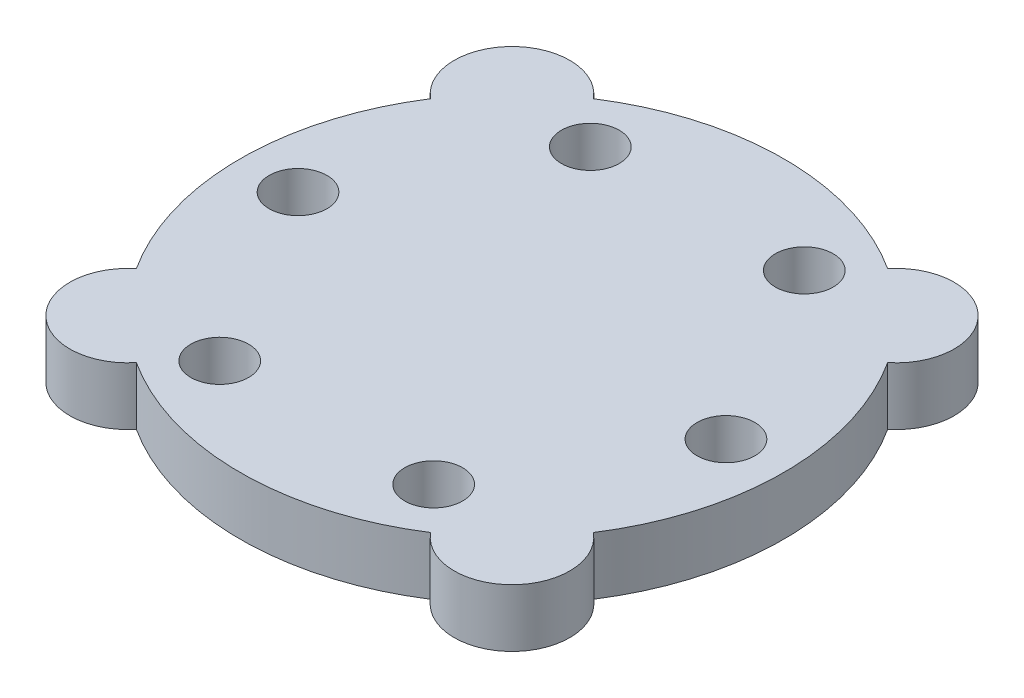
ISO-10303-21;
HEADER;
FILE_DESCRIPTION(('STEP AP214'),'2;1');
FILE_NAME('part.step','',(''),(''),'','','');
FILE_SCHEMA(('AUTOMOTIVE_DESIGN { 1 0 10303 214 1 1 1 1 }'));
ENDSEC;
DATA;
#1=APPLICATION_CONTEXT('core data for automotive mechanical design processes');
#2=APPLICATION_PROTOCOL_DEFINITION('international standard','automotive_design',2000,#1);
#3=PRODUCT_CONTEXT('',#1,'mechanical');
#4=PRODUCT('Part','Part','',(#3));
#5=PRODUCT_RELATED_PRODUCT_CATEGORY('part','',(#4));
#6=PRODUCT_DEFINITION_FORMATION('','',#4);
#7=PRODUCT_DEFINITION_CONTEXT('part definition',#1,'design');
#8=PRODUCT_DEFINITION('design','',#6,#7);
#9=PRODUCT_DEFINITION_SHAPE('','',#8);
#10=(LENGTH_UNIT() NAMED_UNIT(*) SI_UNIT(.MILLI.,.METRE.));
#11=(NAMED_UNIT(*) PLANE_ANGLE_UNIT() SI_UNIT($,.RADIAN.));
#12=(NAMED_UNIT(*) SI_UNIT($,.STERADIAN.) SOLID_ANGLE_UNIT());
#13=UNCERTAINTY_MEASURE_WITH_UNIT(LENGTH_MEASURE(1.E-05),#10,'distance_accuracy_value','');
#14=(GEOMETRIC_REPRESENTATION_CONTEXT(3) GLOBAL_UNCERTAINTY_ASSIGNED_CONTEXT((#13)) GLOBAL_UNIT_ASSIGNED_CONTEXT((#10,
#11,#12)) REPRESENTATION_CONTEXT('',''));
#15=CARTESIAN_POINT('',(0.,0.,0.));
#16=DIRECTION('',(0.,0.,1.));
#17=DIRECTION('',(1.,0.,0.));
#18=AXIS2_PLACEMENT_3D('',#15,#16,#17);
#19=CARTESIAN_POINT('',(0.,0.25,0.));
#20=DIRECTION('',(0.,-1.,0.));
#21=DIRECTION('',(0.,0.,-1.));
#22=AXIS2_PLACEMENT_3D('',#19,#20,#21);
#23=CYLINDRICAL_SURFACE('',#22,2.35);
#24=CARTESIAN_POINT('',(0.,-0.25,0.));
#25=DIRECTION('',(0.,1.,0.));
#26=DIRECTION('',(0.,0.,1.));
#27=AXIS2_PLACEMENT_3D('',#24,#25,#26);
#28=CIRCLE('',#27,2.35);
#29=CARTESIAN_POINT('',(-1.27254181674957,-0.25,1.97563592916906));
#30=VERTEX_POINT('',#29);
#31=CARTESIAN_POINT('',(1.27254181674956,-0.25,1.97563592916907));
#32=VERTEX_POINT('',#31);
#33=EDGE_CURVE('E130',#30,#32,#28,.T.);
#34=ORIENTED_EDGE('',*,*,#33,.T.);
#35=DIRECTION('',(0.,-1.,0.));
#36=VECTOR('',#35,1.);
#37=CARTESIAN_POINT('',(1.27254181674956,0.25,1.97563592916907));
#38=LINE('',#37,#36);
#39=CARTESIAN_POINT('',(1.27254181674956,0.25,1.97563592916907));
#40=VERTEX_POINT('',#39);
#41=EDGE_CURVE('E11',#40,#32,#38,.T.);
#42=ORIENTED_EDGE('',*,*,#41,.F.);
#43=CARTESIAN_POINT('',(0.,0.25,0.));
#44=DIRECTION('',(0.,1.,0.));
#45=DIRECTION('',(0.,0.,1.));
#46=AXIS2_PLACEMENT_3D('',#43,#44,#45);
#47=CIRCLE('',#46,2.35);
#48=CARTESIAN_POINT('',(-1.27254181674957,0.25,1.97563592916906));
#49=VERTEX_POINT('',#48);
#50=EDGE_CURVE('E145',#49,#40,#47,.T.);
#51=ORIENTED_EDGE('',*,*,#50,.F.);
#52=DIRECTION('',(0.,-1.,0.));
#53=VECTOR('',#52,1.);
#54=CARTESIAN_POINT('',(-1.27254181674957,0.25,1.97563592916906));
#55=LINE('',#54,#53);
#56=EDGE_CURVE('E126',#49,#30,#55,.T.);
#57=ORIENTED_EDGE('',*,*,#56,.T.);
#58=EDGE_LOOP('',(#34,#42,#51,#57));
#59=FACE_BOUND('',#58,.T.);
#60=ADVANCED_FACE('F34',(#59),#23,.T.);
#61=CARTESIAN_POINT('',(1.66170093578838,0.25,1.66170093578839));
#62=DIRECTION('',(0.,-1.,0.));
#63=DIRECTION('',(0.,0.,-1.));
#64=AXIS2_PLACEMENT_3D('',#61,#62,#63);
#65=CYLINDRICAL_SURFACE('',#64,0.5);
#66=CARTESIAN_POINT('',(1.66170093578838,-0.25,1.66170093578839));
#67=DIRECTION('',(0.,1.,0.));
#68=DIRECTION('',(0.,0.,1.));
#69=AXIS2_PLACEMENT_3D('',#66,#67,#68);
#70=CIRCLE('',#69,0.5);
#71=CARTESIAN_POINT('',(1.97563592916906,-0.25,1.27254181674957));
#72=VERTEX_POINT('',#71);
#73=EDGE_CURVE('E133',#32,#72,#70,.T.);
#74=ORIENTED_EDGE('',*,*,#73,.T.);
#75=DIRECTION('',(0.,-1.,0.));
#76=VECTOR('',#75,1.);
#77=CARTESIAN_POINT('',(1.97563592916906,0.25,1.27254181674957));
#78=LINE('',#77,#76);
#79=CARTESIAN_POINT('',(1.97563592916906,0.25,1.27254181674957));
#80=VERTEX_POINT('',#79);
#81=EDGE_CURVE('E42',#80,#72,#78,.T.);
#82=ORIENTED_EDGE('',*,*,#81,.F.);
#83=CARTESIAN_POINT('',(1.66170093578838,0.25,1.66170093578839));
#84=DIRECTION('',(0.,1.,0.));
#85=DIRECTION('',(0.,0.,1.));
#86=AXIS2_PLACEMENT_3D('',#83,#84,#85);
#87=CIRCLE('',#86,0.5);
#88=EDGE_CURVE('E93',#40,#80,#87,.T.);
#89=ORIENTED_EDGE('',*,*,#88,.F.);
#90=ORIENTED_EDGE('',*,*,#41,.T.);
#91=EDGE_LOOP('',(#74,#82,#89,#90));
#92=FACE_BOUND('',#91,.T.);
#93=ADVANCED_FACE('F247',(#92),#65,.T.);
#94=CARTESIAN_POINT('',(0.,0.25,0.));
#95=DIRECTION('',(0.,-1.,0.));
#96=DIRECTION('',(0.,0.,-1.));
#97=AXIS2_PLACEMENT_3D('',#94,#95,#96);
#98=CYLINDRICAL_SURFACE('',#97,2.35);
#99=CARTESIAN_POINT('',(0.,-0.25,0.));
#100=DIRECTION('',(0.,1.,0.));
#101=DIRECTION('',(0.,0.,1.));
#102=AXIS2_PLACEMENT_3D('',#99,#100,#101);
#103=CIRCLE('',#102,2.35);
#104=CARTESIAN_POINT('',(1.97563592916907,-0.25,-1.27254181674956));
#105=VERTEX_POINT('',#104);
#106=EDGE_CURVE('E136',#72,#105,#103,.T.);
#107=ORIENTED_EDGE('',*,*,#106,.T.);
#108=DIRECTION('',(0.,-1.,0.));
#109=VECTOR('',#108,1.);
#110=CARTESIAN_POINT('',(1.97563592916907,0.25,-1.27254181674956));
#111=LINE('',#110,#109);
#112=CARTESIAN_POINT('',(1.97563592916907,0.25,-1.27254181674956));
#113=VERTEX_POINT('',#112);
#114=EDGE_CURVE('E152',#113,#105,#111,.T.);
#115=ORIENTED_EDGE('',*,*,#114,.F.);
#116=CARTESIAN_POINT('',(0.,0.25,0.));
#117=DIRECTION('',(0.,1.,0.));
#118=DIRECTION('',(0.,0.,1.));
#119=AXIS2_PLACEMENT_3D('',#116,#117,#118);
#120=CIRCLE('',#119,2.35);
#121=EDGE_CURVE('E160',#80,#113,#120,.T.);
#122=ORIENTED_EDGE('',*,*,#121,.F.);
#123=ORIENTED_EDGE('',*,*,#81,.T.);
#124=EDGE_LOOP('',(#107,#115,#122,#123));
#125=FACE_BOUND('',#124,.T.);
#126=ADVANCED_FACE('F158',(#125),#98,.T.);
#127=CARTESIAN_POINT('',(1.66170093578839,0.25,-1.66170093578838));
#128=DIRECTION('',(0.,-1.,0.));
#129=DIRECTION('',(0.,0.,-1.));
#130=AXIS2_PLACEMENT_3D('',#127,#128,#129);
#131=CYLINDRICAL_SURFACE('',#130,0.500000000000001);
#132=CARTESIAN_POINT('',(1.66170093578839,-0.25,-1.66170093578838));
#133=DIRECTION('',(0.,1.,0.));
#134=DIRECTION('',(0.,0.,1.));
#135=AXIS2_PLACEMENT_3D('',#132,#133,#134);
#136=CIRCLE('',#135,0.500000000000001);
#137=CARTESIAN_POINT('',(1.27254181674957,-0.25,-1.97563592916906));
#138=VERTEX_POINT('',#137);
#139=EDGE_CURVE('E138',#105,#138,#136,.T.);
#140=ORIENTED_EDGE('',*,*,#139,.T.);
#141=DIRECTION('',(0.,-1.,0.));
#142=VECTOR('',#141,1.);
#143=CARTESIAN_POINT('',(1.27254181674957,0.25,-1.97563592916906));
#144=LINE('',#143,#142);
#145=CARTESIAN_POINT('',(1.27254181674957,0.25,-1.97563592916906));
#146=VERTEX_POINT('',#145);
#147=EDGE_CURVE('E149',#146,#138,#144,.T.);
#148=ORIENTED_EDGE('',*,*,#147,.F.);
#149=CARTESIAN_POINT('',(1.66170093578839,0.25,-1.66170093578838));
#150=DIRECTION('',(0.,1.,0.));
#151=DIRECTION('',(0.,0.,1.));
#152=AXIS2_PLACEMENT_3D('',#149,#150,#151);
#153=CIRCLE('',#152,0.500000000000001);
#154=EDGE_CURVE('E172',#113,#146,#153,.T.);
#155=ORIENTED_EDGE('',*,*,#154,.F.);
#156=ORIENTED_EDGE('',*,*,#114,.T.);
#157=EDGE_LOOP('',(#140,#148,#155,#156));
#158=FACE_BOUND('',#157,.T.);
#159=ADVANCED_FACE('F168',(#158),#131,.T.);
#160=CARTESIAN_POINT('',(0.,0.25,0.));
#161=DIRECTION('',(0.,-1.,0.));
#162=DIRECTION('',(0.,0.,-1.));
#163=AXIS2_PLACEMENT_3D('',#160,#161,#162);
#164=CYLINDRICAL_SURFACE('',#163,2.35);
#165=CARTESIAN_POINT('',(0.,-0.25,0.));
#166=DIRECTION('',(0.,1.,0.));
#167=DIRECTION('',(0.,0.,1.));
#168=AXIS2_PLACEMENT_3D('',#165,#166,#167);
#169=CIRCLE('',#168,2.35);
#170=CARTESIAN_POINT('',(-1.27254181674956,-0.25,-1.97563592916907));
#171=VERTEX_POINT('',#170);
#172=EDGE_CURVE('E140',#138,#171,#169,.T.);
#173=ORIENTED_EDGE('',*,*,#172,.T.);
#174=DIRECTION('',(0.,-1.,0.));
#175=VECTOR('',#174,1.);
#176=CARTESIAN_POINT('',(-1.27254181674956,0.25,-1.97563592916907));
#177=LINE('',#176,#175);
#178=CARTESIAN_POINT('',(-1.27254181674956,0.25,-1.97563592916907));
#179=VERTEX_POINT('',#178);
#180=EDGE_CURVE('E121',#179,#171,#177,.T.);
#181=ORIENTED_EDGE('',*,*,#180,.F.);
#182=CARTESIAN_POINT('',(0.,0.25,0.));
#183=DIRECTION('',(0.,1.,0.));
#184=DIRECTION('',(0.,0.,1.));
#185=AXIS2_PLACEMENT_3D('',#182,#183,#184);
#186=CIRCLE('',#185,2.35);
#187=EDGE_CURVE('E112',#146,#179,#186,.T.);
#188=ORIENTED_EDGE('',*,*,#187,.F.);
#189=ORIENTED_EDGE('',*,*,#147,.T.);
#190=EDGE_LOOP('',(#173,#181,#188,#189));
#191=FACE_BOUND('',#190,.T.);
#192=ADVANCED_FACE('F171',(#191),#164,.T.);
#193=CARTESIAN_POINT('',(-1.66170093578838,0.25,-1.66170093578839));
#194=DIRECTION('',(0.,-1.,0.));
#195=DIRECTION('',(0.,0.,-1.));
#196=AXIS2_PLACEMENT_3D('',#193,#194,#195);
#197=CYLINDRICAL_SURFACE('',#196,0.5);
#198=CARTESIAN_POINT('',(-1.66170093578838,-0.25,-1.66170093578839));
#199=DIRECTION('',(0.,1.,0.));
#200=DIRECTION('',(0.,0.,1.));
#201=AXIS2_PLACEMENT_3D('',#198,#199,#200);
#202=CIRCLE('',#201,0.5);
#203=CARTESIAN_POINT('',(-1.97563592916906,-0.25,-1.27254181674957));
#204=VERTEX_POINT('',#203);
#205=EDGE_CURVE('E120',#171,#204,#202,.T.);
#206=ORIENTED_EDGE('',*,*,#205,.T.);
#207=DIRECTION('',(0.,-1.,0.));
#208=VECTOR('',#207,1.);
#209=CARTESIAN_POINT('',(-1.97563592916906,0.25,-1.27254181674957));
#210=LINE('',#209,#208);
#211=CARTESIAN_POINT('',(-1.97563592916906,0.25,-1.27254181674957));
#212=VERTEX_POINT('',#211);
#213=EDGE_CURVE('E117',#212,#204,#210,.T.);
#214=ORIENTED_EDGE('',*,*,#213,.F.);
#215=CARTESIAN_POINT('',(-1.66170093578838,0.25,-1.66170093578839));
#216=DIRECTION('',(0.,1.,0.));
#217=DIRECTION('',(0.,0.,1.));
#218=AXIS2_PLACEMENT_3D('',#215,#216,#217);
#219=CIRCLE('',#218,0.5);
#220=EDGE_CURVE('E106',#179,#212,#219,.T.);
#221=ORIENTED_EDGE('',*,*,#220,.F.);
#222=ORIENTED_EDGE('',*,*,#180,.T.);
#223=EDGE_LOOP('',(#206,#214,#221,#222));
#224=FACE_BOUND('',#223,.T.);
#225=ADVANCED_FACE('F118',(#224),#197,.T.);
#226=CARTESIAN_POINT('',(0.,0.25,0.));
#227=DIRECTION('',(0.,-1.,0.));
#228=DIRECTION('',(0.,0.,-1.));
#229=AXIS2_PLACEMENT_3D('',#226,#227,#228);
#230=CYLINDRICAL_SURFACE('',#229,2.35);
#231=CARTESIAN_POINT('',(0.,-0.25,0.));
#232=DIRECTION('',(0.,1.,0.));
#233=DIRECTION('',(0.,0.,1.));
#234=AXIS2_PLACEMENT_3D('',#231,#232,#233);
#235=CIRCLE('',#234,2.35);
#236=CARTESIAN_POINT('',(-1.97563592916907,-0.25,1.27254181674956));
#237=VERTEX_POINT('',#236);
#238=EDGE_CURVE('E79',#204,#237,#235,.T.);
#239=ORIENTED_EDGE('',*,*,#238,.T.);
#240=DIRECTION('',(0.,-1.,0.));
#241=VECTOR('',#240,1.);
#242=CARTESIAN_POINT('',(-1.97563592916907,0.25,1.27254181674956));
#243=LINE('',#242,#241);
#244=CARTESIAN_POINT('',(-1.97563592916907,0.25,1.27254181674956));
#245=VERTEX_POINT('',#244);
#246=EDGE_CURVE('E122',#245,#237,#243,.T.);
#247=ORIENTED_EDGE('',*,*,#246,.F.);
#248=CARTESIAN_POINT('',(0.,0.25,0.));
#249=DIRECTION('',(0.,1.,0.));
#250=DIRECTION('',(0.,0.,1.));
#251=AXIS2_PLACEMENT_3D('',#248,#249,#250);
#252=CIRCLE('',#251,2.35);
#253=EDGE_CURVE('E110',#212,#245,#252,.T.);
#254=ORIENTED_EDGE('',*,*,#253,.F.);
#255=ORIENTED_EDGE('',*,*,#213,.T.);
#256=EDGE_LOOP('',(#239,#247,#254,#255));
#257=FACE_BOUND('',#256,.T.);
#258=ADVANCED_FACE('F124',(#257),#230,.T.);
#259=CARTESIAN_POINT('',(-1.66170093578839,0.25,1.66170093578838));
#260=DIRECTION('',(0.,-1.,0.));
#261=DIRECTION('',(0.,0.,-1.));
#262=AXIS2_PLACEMENT_3D('',#259,#260,#261);
#263=CYLINDRICAL_SURFACE('',#262,0.500000000000001);
#264=CARTESIAN_POINT('',(-1.66170093578839,-0.25,1.66170093578838));
#265=DIRECTION('',(0.,1.,0.));
#266=DIRECTION('',(0.,0.,1.));
#267=AXIS2_PLACEMENT_3D('',#264,#265,#266);
#268=CIRCLE('',#267,0.500000000000001);
#269=EDGE_CURVE('E85',#237,#30,#268,.T.);
#270=ORIENTED_EDGE('',*,*,#269,.T.);
#271=ORIENTED_EDGE('',*,*,#56,.F.);
#272=CARTESIAN_POINT('',(-1.66170093578839,0.25,1.66170093578838));
#273=DIRECTION('',(0.,1.,0.));
#274=DIRECTION('',(0.,0.,1.));
#275=AXIS2_PLACEMENT_3D('',#272,#273,#274);
#276=CIRCLE('',#275,0.500000000000001);
#277=EDGE_CURVE('E50',#245,#49,#276,.T.);
#278=ORIENTED_EDGE('',*,*,#277,.F.);
#279=ORIENTED_EDGE('',*,*,#246,.T.);
#280=EDGE_LOOP('',(#270,#271,#278,#279));
#281=FACE_BOUND('',#280,.T.);
#282=ADVANCED_FACE('F219',(#281),#263,.T.);
#283=CARTESIAN_POINT('',(0.830850467894192,0.25,0.830850467894194));
#284=DIRECTION('',(0.,1.,0.));
#285=DIRECTION('',(0.,0.,1.));
#286=AXIS2_PLACEMENT_3D('',#283,#284,#285);
#287=PLANE('',#286);
#288=CARTESIAN_POINT('',(-0.925000000000019,0.25,1.6021469970012));
#289=DIRECTION('',(0.,1.,0.));
#290=DIRECTION('',(0.,0.,1.));
#291=AXIS2_PLACEMENT_3D('',#288,#289,#290);
#292=CIRCLE('',#291,0.25);
#293=CARTESIAN_POINT('',(-0.925000000000019,0.25,1.8521469970012));
#294=VERTEX_POINT('',#293);
#295=EDGE_CURVE('E210',#294,#294,#292,.T.);
#296=ORIENTED_EDGE('',*,*,#295,.F.);
#297=EDGE_LOOP('',(#296));
#298=FACE_BOUND('',#297,.T.);
#299=CARTESIAN_POINT('',(0.924999999999985,0.25,1.60214699700122));
#300=DIRECTION('',(0.,1.,0.));
#301=DIRECTION('',(0.,0.,1.));
#302=AXIS2_PLACEMENT_3D('',#299,#300,#301);
#303=CIRCLE('',#302,0.250000000000001);
#304=CARTESIAN_POINT('',(0.924999999999985,0.25,1.85214699700122));
#305=VERTEX_POINT('',#304);
#306=EDGE_CURVE('E204',#305,#305,#303,.T.);
#307=ORIENTED_EDGE('',*,*,#306,.F.);
#308=EDGE_LOOP('',(#307));
#309=FACE_BOUND('',#308,.T.);
#310=CARTESIAN_POINT('',(1.85,0.25,0.));
#311=DIRECTION('',(0.,1.,0.));
#312=DIRECTION('',(0.,0.,1.));
#313=AXIS2_PLACEMENT_3D('',#310,#311,#312);
#314=CIRCLE('',#313,0.250000000000005);
#315=CARTESIAN_POINT('',(1.85,0.25,0.250000000000004));
#316=VERTEX_POINT('',#315);
#317=EDGE_CURVE('E198',#316,#316,#314,.T.);
#318=ORIENTED_EDGE('',*,*,#317,.F.);
#319=EDGE_LOOP('',(#318));
#320=FACE_BOUND('',#319,.T.);
#321=CARTESIAN_POINT('',(0.925000000000008,0.25,-1.60214699700121));
#322=DIRECTION('',(0.,1.,0.));
#323=DIRECTION('',(0.,0.,1.));
#324=AXIS2_PLACEMENT_3D('',#321,#322,#323);
#325=CIRCLE('',#324,0.25);
#326=CARTESIAN_POINT('',(0.925000000000008,0.25,-1.35214699700121));
#327=VERTEX_POINT('',#326);
#328=EDGE_CURVE('E192',#327,#327,#325,.T.);
#329=ORIENTED_EDGE('',*,*,#328,.F.);
#330=EDGE_LOOP('',(#329));
#331=FACE_BOUND('',#330,.T.);
#332=CARTESIAN_POINT('',(-0.924999999999996,0.25,-1.60214699700121));
#333=DIRECTION('',(0.,1.,0.));
#334=DIRECTION('',(0.,0.,1.));
#335=AXIS2_PLACEMENT_3D('',#332,#333,#334);
#336=CIRCLE('',#335,0.25);
#337=CARTESIAN_POINT('',(-0.924999999999996,0.25,-1.35214699700121));
#338=VERTEX_POINT('',#337);
#339=EDGE_CURVE('E186',#338,#338,#336,.T.);
#340=ORIENTED_EDGE('',*,*,#339,.F.);
#341=EDGE_LOOP('',(#340));
#342=FACE_BOUND('',#341,.T.);
#343=CARTESIAN_POINT('',(-1.85,0.25,0.));
#344=DIRECTION('',(0.,1.,0.));
#345=DIRECTION('',(0.,0.,1.));
#346=AXIS2_PLACEMENT_3D('',#343,#344,#345);
#347=CIRCLE('',#346,0.250000000000001);
#348=CARTESIAN_POINT('',(-1.85,0.25,0.250000000000001));
#349=VERTEX_POINT('',#348);
#350=EDGE_CURVE('E180',#349,#349,#347,.T.);
#351=ORIENTED_EDGE('',*,*,#350,.F.);
#352=EDGE_LOOP('',(#351));
#353=FACE_BOUND('',#352,.T.);
#354=ORIENTED_EDGE('',*,*,#50,.T.);
#355=ORIENTED_EDGE('',*,*,#88,.T.);
#356=ORIENTED_EDGE('',*,*,#121,.T.);
#357=ORIENTED_EDGE('',*,*,#154,.T.);
#358=ORIENTED_EDGE('',*,*,#187,.T.);
#359=ORIENTED_EDGE('',*,*,#220,.T.);
#360=ORIENTED_EDGE('',*,*,#253,.T.);
#361=ORIENTED_EDGE('',*,*,#277,.T.);
#362=EDGE_LOOP('',(#354,#355,#356,#357,#358,#359,#360,#361));
#363=FACE_BOUND('',#362,.T.);
#364=ADVANCED_FACE('F108',(#298,#309,#320,#331,#342,#353,#363),#287,.T.);
#365=CARTESIAN_POINT('',(0.830850467894192,-0.25,0.830850467894194));
#366=DIRECTION('',(0.,1.,0.));
#367=DIRECTION('',(0.,0.,1.));
#368=AXIS2_PLACEMENT_3D('',#365,#366,#367);
#369=PLANE('',#368);
#370=CARTESIAN_POINT('',(-0.925000000000019,-0.25,1.6021469970012));
#371=DIRECTION('',(0.,1.,0.));
#372=DIRECTION('',(0.,0.,1.));
#373=AXIS2_PLACEMENT_3D('',#370,#371,#372);
#374=CIRCLE('',#373,0.25);
#375=CARTESIAN_POINT('',(-0.925000000000019,-0.25,1.8521469970012));
#376=VERTEX_POINT('',#375);
#377=EDGE_CURVE('E207',#376,#376,#374,.F.);
#378=ORIENTED_EDGE('',*,*,#377,.F.);
#379=EDGE_LOOP('',(#378));
#380=FACE_BOUND('',#379,.T.);
#381=CARTESIAN_POINT('',(0.924999999999985,-0.25,1.60214699700122));
#382=DIRECTION('',(0.,1.,0.));
#383=DIRECTION('',(0.,0.,1.));
#384=AXIS2_PLACEMENT_3D('',#381,#382,#383);
#385=CIRCLE('',#384,0.250000000000001);
#386=CARTESIAN_POINT('',(0.924999999999985,-0.25,1.85214699700122));
#387=VERTEX_POINT('',#386);
#388=EDGE_CURVE('E201',#387,#387,#385,.F.);
#389=ORIENTED_EDGE('',*,*,#388,.F.);
#390=EDGE_LOOP('',(#389));
#391=FACE_BOUND('',#390,.T.);
#392=CARTESIAN_POINT('',(1.85,-0.25,0.));
#393=DIRECTION('',(0.,1.,0.));
#394=DIRECTION('',(0.,0.,1.));
#395=AXIS2_PLACEMENT_3D('',#392,#393,#394);
#396=CIRCLE('',#395,0.250000000000005);
#397=CARTESIAN_POINT('',(1.85,-0.25,0.250000000000004));
#398=VERTEX_POINT('',#397);
#399=EDGE_CURVE('E195',#398,#398,#396,.F.);
#400=ORIENTED_EDGE('',*,*,#399,.F.);
#401=EDGE_LOOP('',(#400));
#402=FACE_BOUND('',#401,.T.);
#403=CARTESIAN_POINT('',(0.925000000000008,-0.25,-1.60214699700121));
#404=DIRECTION('',(0.,1.,0.));
#405=DIRECTION('',(0.,0.,1.));
#406=AXIS2_PLACEMENT_3D('',#403,#404,#405);
#407=CIRCLE('',#406,0.25);
#408=CARTESIAN_POINT('',(0.925000000000008,-0.25,-1.35214699700121));
#409=VERTEX_POINT('',#408);
#410=EDGE_CURVE('E189',#409,#409,#407,.F.);
#411=ORIENTED_EDGE('',*,*,#410,.F.);
#412=EDGE_LOOP('',(#411));
#413=FACE_BOUND('',#412,.T.);
#414=CARTESIAN_POINT('',(-0.924999999999996,-0.25,-1.60214699700121));
#415=DIRECTION('',(0.,1.,0.));
#416=DIRECTION('',(0.,0.,1.));
#417=AXIS2_PLACEMENT_3D('',#414,#415,#416);
#418=CIRCLE('',#417,0.25);
#419=CARTESIAN_POINT('',(-0.924999999999996,-0.25,-1.35214699700121));
#420=VERTEX_POINT('',#419);
#421=EDGE_CURVE('E183',#420,#420,#418,.F.);
#422=ORIENTED_EDGE('',*,*,#421,.F.);
#423=EDGE_LOOP('',(#422));
#424=FACE_BOUND('',#423,.T.);
#425=CARTESIAN_POINT('',(-1.85,-0.25,0.));
#426=DIRECTION('',(0.,1.,0.));
#427=DIRECTION('',(0.,0.,1.));
#428=AXIS2_PLACEMENT_3D('',#425,#426,#427);
#429=CIRCLE('',#428,0.250000000000001);
#430=CARTESIAN_POINT('',(-1.85,-0.25,0.250000000000001));
#431=VERTEX_POINT('',#430);
#432=EDGE_CURVE('E134',#431,#431,#429,.F.);
#433=ORIENTED_EDGE('',*,*,#432,.F.);
#434=EDGE_LOOP('',(#433));
#435=FACE_BOUND('',#434,.T.);
#436=ORIENTED_EDGE('',*,*,#33,.F.);
#437=ORIENTED_EDGE('',*,*,#269,.F.);
#438=ORIENTED_EDGE('',*,*,#238,.F.);
#439=ORIENTED_EDGE('',*,*,#205,.F.);
#440=ORIENTED_EDGE('',*,*,#172,.F.);
#441=ORIENTED_EDGE('',*,*,#139,.F.);
#442=ORIENTED_EDGE('',*,*,#106,.F.);
#443=ORIENTED_EDGE('',*,*,#73,.F.);
#444=EDGE_LOOP('',(#436,#437,#438,#439,#440,#441,#442,#443));
#445=FACE_BOUND('',#444,.T.);
#446=ADVANCED_FACE('F164',(#380,#391,#402,#413,#424,#435,#445),#369,.F.);
#447=CARTESIAN_POINT('',(-1.85,-0.251,0.));
#448=DIRECTION('',(0.,1.,0.));
#449=DIRECTION('',(0.,0.,1.));
#450=AXIS2_PLACEMENT_3D('',#447,#448,#449);
#451=CYLINDRICAL_SURFACE('',#450,0.250000000000001);
#452=ORIENTED_EDGE('',*,*,#350,.T.);
#453=EDGE_LOOP('',(#452));
#454=FACE_BOUND('',#453,.T.);
#455=ORIENTED_EDGE('',*,*,#432,.T.);
#456=EDGE_LOOP('',(#455));
#457=FACE_BOUND('',#456,.T.);
#458=ADVANCED_FACE('F231',(#454,#457),#451,.F.);
#459=CARTESIAN_POINT('',(-0.924999999999996,-0.251,-1.60214699700121));
#460=DIRECTION('',(0.,1.,0.));
#461=DIRECTION('',(0.,0.,1.));
#462=AXIS2_PLACEMENT_3D('',#459,#460,#461);
#463=CYLINDRICAL_SURFACE('',#462,0.25);
#464=ORIENTED_EDGE('',*,*,#339,.T.);
#465=EDGE_LOOP('',(#464));
#466=FACE_BOUND('',#465,.T.);
#467=ORIENTED_EDGE('',*,*,#421,.T.);
#468=EDGE_LOOP('',(#467));
#469=FACE_BOUND('',#468,.T.);
#470=ADVANCED_FACE('F234',(#466,#469),#463,.F.);
#471=CARTESIAN_POINT('',(0.925000000000008,-0.251,-1.60214699700121));
#472=DIRECTION('',(0.,1.,0.));
#473=DIRECTION('',(0.,0.,1.));
#474=AXIS2_PLACEMENT_3D('',#471,#472,#473);
#475=CYLINDRICAL_SURFACE('',#474,0.25);
#476=ORIENTED_EDGE('',*,*,#328,.T.);
#477=EDGE_LOOP('',(#476));
#478=FACE_BOUND('',#477,.T.);
#479=ORIENTED_EDGE('',*,*,#410,.T.);
#480=EDGE_LOOP('',(#479));
#481=FACE_BOUND('',#480,.T.);
#482=ADVANCED_FACE('F316',(#478,#481),#475,.F.);
#483=CARTESIAN_POINT('',(1.85,-0.251,0.));
#484=DIRECTION('',(0.,1.,0.));
#485=DIRECTION('',(0.,0.,1.));
#486=AXIS2_PLACEMENT_3D('',#483,#484,#485);
#487=CYLINDRICAL_SURFACE('',#486,0.250000000000005);
#488=ORIENTED_EDGE('',*,*,#317,.T.);
#489=EDGE_LOOP('',(#488));
#490=FACE_BOUND('',#489,.T.);
#491=ORIENTED_EDGE('',*,*,#399,.T.);
#492=EDGE_LOOP('',(#491));
#493=FACE_BOUND('',#492,.T.);
#494=ADVANCED_FACE('F326',(#490,#493),#487,.F.);
#495=CARTESIAN_POINT('',(0.924999999999985,-0.251,1.60214699700122));
#496=DIRECTION('',(0.,1.,0.));
#497=DIRECTION('',(0.,0.,1.));
#498=AXIS2_PLACEMENT_3D('',#495,#496,#497);
#499=CYLINDRICAL_SURFACE('',#498,0.250000000000001);
#500=ORIENTED_EDGE('',*,*,#306,.T.);
#501=EDGE_LOOP('',(#500));
#502=FACE_BOUND('',#501,.T.);
#503=ORIENTED_EDGE('',*,*,#388,.T.);
#504=EDGE_LOOP('',(#503));
#505=FACE_BOUND('',#504,.T.);
#506=ADVANCED_FACE('F336',(#502,#505),#499,.F.);
#507=CARTESIAN_POINT('',(-0.925000000000019,-0.251,1.6021469970012));
#508=DIRECTION('',(0.,1.,0.));
#509=DIRECTION('',(0.,0.,1.));
#510=AXIS2_PLACEMENT_3D('',#507,#508,#509);
#511=CYLINDRICAL_SURFACE('',#510,0.25);
#512=ORIENTED_EDGE('',*,*,#295,.T.);
#513=EDGE_LOOP('',(#512));
#514=FACE_BOUND('',#513,.T.);
#515=ORIENTED_EDGE('',*,*,#377,.T.);
#516=EDGE_LOOP('',(#515));
#517=FACE_BOUND('',#516,.T.);
#518=ADVANCED_FACE('F214',(#514,#517),#511,.F.);
#519=CLOSED_SHELL('',(#60,#93,#126,#159,#192,#225,#258,#282,#364,#446,#458,#470,#482,#494,#506,#518));
#520=MANIFOLD_SOLID_BREP('B2',#519);
#521=ADVANCED_BREP_SHAPE_REPRESENTATION('',(#18,#520),#14);
#522=SHAPE_DEFINITION_REPRESENTATION(#9,#521);
ENDSEC;
END-ISO-10303-21;
